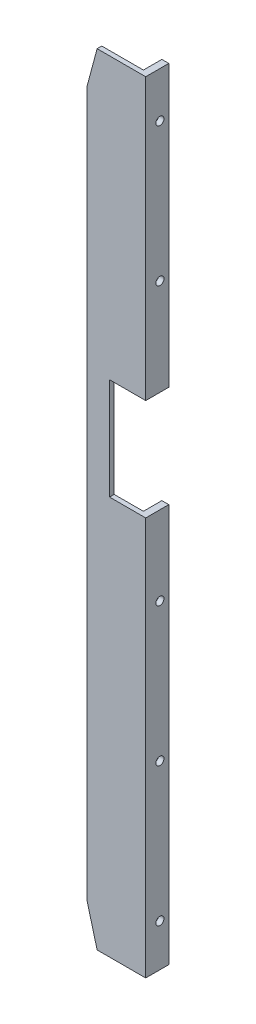
ISO-10303-21;
HEADER;
FILE_DESCRIPTION(('STEP AP214'),'2;1');
FILE_NAME('part.step','',(''),(''),'','','');
FILE_SCHEMA(('AUTOMOTIVE_DESIGN { 1 0 10303 214 1 1 1 1 }'));
ENDSEC;
DATA;
#1=APPLICATION_CONTEXT('core data for automotive mechanical design processes');
#2=APPLICATION_PROTOCOL_DEFINITION('international standard','automotive_design',2000,#1);
#3=PRODUCT_CONTEXT('',#1,'mechanical');
#4=PRODUCT('Part','Part','',(#3));
#5=PRODUCT_RELATED_PRODUCT_CATEGORY('part','',(#4));
#6=PRODUCT_DEFINITION_FORMATION('','',#4);
#7=PRODUCT_DEFINITION_CONTEXT('part definition',#1,'design');
#8=PRODUCT_DEFINITION('design','',#6,#7);
#9=PRODUCT_DEFINITION_SHAPE('','',#8);
#10=(LENGTH_UNIT() NAMED_UNIT(*) SI_UNIT(.MILLI.,.METRE.));
#11=(NAMED_UNIT(*) PLANE_ANGLE_UNIT() SI_UNIT($,.RADIAN.));
#12=(NAMED_UNIT(*) SI_UNIT($,.STERADIAN.) SOLID_ANGLE_UNIT());
#13=UNCERTAINTY_MEASURE_WITH_UNIT(LENGTH_MEASURE(1.E-05),#10,'distance_accuracy_value','');
#14=(GEOMETRIC_REPRESENTATION_CONTEXT(3) GLOBAL_UNCERTAINTY_ASSIGNED_CONTEXT((#13)) GLOBAL_UNIT_ASSIGNED_CONTEXT((#10,
#11,#12)) REPRESENTATION_CONTEXT('',''));
#15=CARTESIAN_POINT('',(0.,0.,0.));
#16=DIRECTION('',(0.,0.,1.));
#17=DIRECTION('',(1.,0.,0.));
#18=AXIS2_PLACEMENT_3D('',#15,#16,#17);
#19=CARTESIAN_POINT('',(198.029133429054,88.353396431631,-13.4124999999996));
#20=DIRECTION('',(0.999999999999998,0.,0.));
#21=DIRECTION('',(0.,0.,-0.999999999999998));
#22=AXIS2_PLACEMENT_3D('',#19,#20,#21);
#23=PLANE('',#22);
#24=CARTESIAN_POINT('',(198.029133429054,-527.011124934766,-7.640243296269));
#25=DIRECTION('',(0.999999999999998,0.,0.));
#26=DIRECTION('',(0.,0.,-0.999999999999998));
#27=AXIS2_PLACEMENT_3D('',#24,#25,#26);
#28=CIRCLE('',#27,2.19709999999995);
#29=CARTESIAN_POINT('',(198.029133429054,-527.011124934766,-9.83734329626895));
#30=VERTEX_POINT('',#29);
#31=EDGE_CURVE('E54',#30,#30,#28,.T.);
#32=ORIENTED_EDGE('',*,*,#31,.T.);
#33=EDGE_LOOP('',(#32));
#34=FACE_BOUND('',#33,.T.);
#35=CARTESIAN_POINT('',(198.029133429054,-437.011124934766,-7.640243296269));
#36=DIRECTION('',(0.999999999999998,0.,0.));
#37=DIRECTION('',(0.,0.,-0.999999999999998));
#38=AXIS2_PLACEMENT_3D('',#35,#36,#37);
#39=CIRCLE('',#38,2.19710000000001);
#40=CARTESIAN_POINT('',(198.029133429054,-437.011124934766,-9.837343296269));
#41=VERTEX_POINT('',#40);
#42=EDGE_CURVE('E291',#41,#41,#39,.T.);
#43=ORIENTED_EDGE('',*,*,#42,.T.);
#44=EDGE_LOOP('',(#43));
#45=FACE_BOUND('',#44,.T.);
#46=CARTESIAN_POINT('',(198.029133429054,-347.011124934766,-7.640243296269));
#47=DIRECTION('',(0.999999999999998,0.,0.));
#48=DIRECTION('',(0.,0.,-0.999999999999998));
#49=AXIS2_PLACEMENT_3D('',#46,#47,#48);
#50=CIRCLE('',#49,2.19710000000001);
#51=CARTESIAN_POINT('',(198.029133429054,-347.011124934766,-9.837343296269));
#52=VERTEX_POINT('',#51);
#53=EDGE_CURVE('E283',#52,#52,#50,.T.);
#54=ORIENTED_EDGE('',*,*,#53,.T.);
#55=EDGE_LOOP('',(#54));
#56=FACE_BOUND('',#55,.T.);
#57=DIRECTION('',(0.,-1.,0.));
#58=VECTOR('',#57,1.);
#59=CARTESIAN_POINT('',(198.029133429054,88.353396431631,-1.41250000000001));
#60=LINE('',#59,#58);
#61=CARTESIAN_POINT('',(198.029133429054,-295.700000000001,-1.41249999999979));
#62=VERTEX_POINT('',#61);
#63=CARTESIAN_POINT('',(198.029133429054,-554.500000000002,-1.41249999999979));
#64=VERTEX_POINT('',#63);
#65=EDGE_CURVE('E246',#62,#64,#60,.T.);
#66=ORIENTED_EDGE('',*,*,#65,.F.);
#67=DIRECTION('',(0.,0.,-0.999999999999998));
#68=VECTOR('',#67,1.);
#69=CARTESIAN_POINT('',(198.029133429054,-295.700000000001,-13.4124999999996));
#70=LINE('',#69,#68);
#71=CARTESIAN_POINT('',(198.029133429054,-295.700000000001,-13.4124999999996));
#72=VERTEX_POINT('',#71);
#73=EDGE_CURVE('E182',#62,#72,#70,.T.);
#74=ORIENTED_EDGE('',*,*,#73,.T.);
#75=DIRECTION('',(0.,-1.,0.));
#76=VECTOR('',#75,1.);
#77=CARTESIAN_POINT('',(198.029133429054,88.353396431631,-13.4124999999996));
#78=LINE('',#77,#76);
#79=CARTESIAN_POINT('',(198.029133429054,-554.500000000002,-13.4125));
#80=VERTEX_POINT('',#79);
#81=EDGE_CURVE('E248',#72,#80,#78,.T.);
#82=ORIENTED_EDGE('',*,*,#81,.T.);
#83=DIRECTION('',(0.,0.,-0.999999999999998));
#84=VECTOR('',#83,1.);
#85=CARTESIAN_POINT('',(198.029133429054,-554.500000000002,-13.4125));
#86=LINE('',#85,#84);
#87=EDGE_CURVE('E208',#64,#80,#86,.T.);
#88=ORIENTED_EDGE('',*,*,#87,.F.);
#89=EDGE_LOOP('',(#66,#74,#82,#88));
#90=FACE_BOUND('',#89,.T.);
#91=ADVANCED_FACE('F50',(#34,#45,#56,#90),#23,.F.);
#92=CARTESIAN_POINT('',(198.029133429054,88.353396431631,-13.4124999999996));
#93=DIRECTION('',(0.,0.,0.999999999999998));
#94=DIRECTION('',(0.999999999999998,0.,0.));
#95=AXIS2_PLACEMENT_3D('',#92,#93,#94);
#96=PLANE('',#95);
#97=ORIENTED_EDGE('',*,*,#81,.F.);
#98=DIRECTION('',(0.999999999999998,0.,0.));
#99=VECTOR('',#98,1.);
#100=CARTESIAN_POINT('',(198.029133429054,-295.700000000001,-13.4124999999996));
#101=LINE('',#100,#99);
#102=CARTESIAN_POINT('',(202.529133429054,-295.700000000001,-13.4124999999996));
#103=VERTEX_POINT('',#102);
#104=EDGE_CURVE('E175',#72,#103,#101,.T.);
#105=ORIENTED_EDGE('',*,*,#104,.T.);
#106=DIRECTION('',(0.,-1.,0.));
#107=VECTOR('',#106,1.);
#108=CARTESIAN_POINT('',(202.529133429054,88.3533964316319,-13.4124999999996));
#109=LINE('',#108,#107);
#110=CARTESIAN_POINT('',(202.529133429054,-554.500000000003,-13.4125));
#111=VERTEX_POINT('',#110);
#112=EDGE_CURVE('E252',#103,#111,#109,.T.);
#113=ORIENTED_EDGE('',*,*,#112,.T.);
#114=DIRECTION('',(0.999999999999998,0.,0.));
#115=VECTOR('',#114,1.);
#116=CARTESIAN_POINT('',(198.029133429054,-554.500000000002,-13.4125));
#117=LINE('',#116,#115);
#118=EDGE_CURVE('E220',#80,#111,#117,.T.);
#119=ORIENTED_EDGE('',*,*,#118,.F.);
#120=EDGE_LOOP('',(#97,#105,#113,#119));
#121=FACE_BOUND('',#120,.T.);
#122=ADVANCED_FACE('F353',(#121),#96,.F.);
#123=CARTESIAN_POINT('',(202.529133429054,88.3533964316319,-13.4124999999996));
#124=DIRECTION('',(-0.999999999999998,0.,0.));
#125=DIRECTION('',(0.,0.,0.999999999999998));
#126=AXIS2_PLACEMENT_3D('',#123,#124,#125);
#127=PLANE('',#126);
#128=CARTESIAN_POINT('',(202.529133429054,-527.011124934767,-7.640243296269));
#129=DIRECTION('',(-0.999999999999998,0.,0.));
#130=DIRECTION('',(0.,0.,0.999999999999998));
#131=AXIS2_PLACEMENT_3D('',#128,#129,#130);
#132=CIRCLE('',#131,2.63778999999997);
#133=CARTESIAN_POINT('',(202.529133429054,-527.011124934767,-5.00245329626903));
#134=VERTEX_POINT('',#133);
#135=EDGE_CURVE('E295',#134,#134,#132,.T.);
#136=ORIENTED_EDGE('',*,*,#135,.T.);
#137=EDGE_LOOP('',(#136));
#138=FACE_BOUND('',#137,.T.);
#139=CARTESIAN_POINT('',(202.529133429054,-437.011124934766,-7.640243296269));
#140=DIRECTION('',(-0.999999999999998,0.,0.));
#141=DIRECTION('',(0.,0.,0.999999999999998));
#142=AXIS2_PLACEMENT_3D('',#139,#140,#141);
#143=CIRCLE('',#142,2.63778999999997);
#144=CARTESIAN_POINT('',(202.529133429054,-437.011124934766,-5.00245329626903));
#145=VERTEX_POINT('',#144);
#146=EDGE_CURVE('E288',#145,#145,#143,.T.);
#147=ORIENTED_EDGE('',*,*,#146,.T.);
#148=EDGE_LOOP('',(#147));
#149=FACE_BOUND('',#148,.T.);
#150=CARTESIAN_POINT('',(202.529133429054,-347.011124934766,-7.640243296269));
#151=DIRECTION('',(-0.999999999999998,0.,0.));
#152=DIRECTION('',(0.,0.,0.999999999999998));
#153=AXIS2_PLACEMENT_3D('',#150,#151,#152);
#154=CIRCLE('',#153,2.63778999999997);
#155=CARTESIAN_POINT('',(202.529133429054,-347.011124934766,-5.00245329626903));
#156=VERTEX_POINT('',#155);
#157=EDGE_CURVE('E280',#156,#156,#154,.T.);
#158=ORIENTED_EDGE('',*,*,#157,.T.);
#159=EDGE_LOOP('',(#158));
#160=FACE_BOUND('',#159,.T.);
#161=ORIENTED_EDGE('',*,*,#112,.F.);
#162=DIRECTION('',(0.,0.,0.999999999999998));
#163=VECTOR('',#162,1.);
#164=CARTESIAN_POINT('',(202.529133429054,-295.700000000001,-13.4124999999996));
#165=LINE('',#164,#163);
#166=CARTESIAN_POINT('',(202.529133429054,-295.700000000001,1.58750000000021));
#167=VERTEX_POINT('',#166);
#168=EDGE_CURVE('E59',#103,#167,#165,.T.);
#169=ORIENTED_EDGE('',*,*,#168,.T.);
#170=DIRECTION('',(0.,-1.,0.));
#171=VECTOR('',#170,1.);
#172=CARTESIAN_POINT('',(202.529133429054,88.3533964316319,1.58749999999999));
#173=LINE('',#172,#171);
#174=CARTESIAN_POINT('',(202.529133429054,-554.500000000003,1.58750000000002));
#175=VERTEX_POINT('',#174);
#176=EDGE_CURVE('E223',#167,#175,#173,.T.);
#177=ORIENTED_EDGE('',*,*,#176,.T.);
#178=DIRECTION('',(0.,0.,0.999999999999998));
#179=VECTOR('',#178,1.);
#180=CARTESIAN_POINT('',(202.529133429054,-554.500000000003,-13.4125));
#181=LINE('',#180,#179);
#182=EDGE_CURVE('E217',#111,#175,#181,.T.);
#183=ORIENTED_EDGE('',*,*,#182,.F.);
#184=EDGE_LOOP('',(#161,#169,#177,#183));
#185=FACE_BOUND('',#184,.T.);
#186=ADVANCED_FACE('F356',(#138,#149,#160,#185),#127,.F.);
#187=CARTESIAN_POINT('',(164.529133429054,88.353396431631,1.58749999999977));
#188=DIRECTION('',(0.,0.,-0.999999999999998));
#189=DIRECTION('',(-0.999999999999998,0.,0.));
#190=AXIS2_PLACEMENT_3D('',#187,#188,#189);
#191=PLANE('',#190);
#192=ORIENTED_EDGE('',*,*,#176,.F.);
#193=DIRECTION('',(-0.999999999999998,0.,0.));
#194=VECTOR('',#193,1.);
#195=CARTESIAN_POINT('',(164.529133429054,-295.700000000001,1.58749999999999));
#196=LINE('',#195,#194);
#197=CARTESIAN_POINT('',(179.029133429054,-295.700000000001,1.58750000000021));
#198=VERTEX_POINT('',#197);
#199=EDGE_CURVE('E187',#167,#198,#196,.T.);
#200=ORIENTED_EDGE('',*,*,#199,.T.);
#201=DIRECTION('',(0.,1.,0.));
#202=VECTOR('',#201,1.);
#203=CARTESIAN_POINT('',(179.029133429054,88.353396431631,1.58749999999999));
#204=LINE('',#203,#202);
#205=CARTESIAN_POINT('',(179.029133429054,-229.700000000001,1.58749999999999));
#206=VERTEX_POINT('',#205);
#207=EDGE_CURVE('E190',#198,#206,#204,.T.);
#208=ORIENTED_EDGE('',*,*,#207,.T.);
#209=DIRECTION('',(0.999999999999998,0.,0.));
#210=VECTOR('',#209,1.);
#211=CARTESIAN_POINT('',(164.529133429054,-229.700000000002,1.58749999999977));
#212=LINE('',#211,#210);
#213=CARTESIAN_POINT('',(202.529133429054,-229.700000000001,1.58749999999999));
#214=VERTEX_POINT('',#213);
#215=EDGE_CURVE('E166',#206,#214,#212,.T.);
#216=ORIENTED_EDGE('',*,*,#215,.T.);
#217=CARTESIAN_POINT('',(202.529133429054,-47.5,1.58749999999999));
#218=VERTEX_POINT('',#217);
#219=EDGE_CURVE('E237',#218,#214,#173,.T.);
#220=ORIENTED_EDGE('',*,*,#219,.F.);
#221=DIRECTION('',(-0.999999999999998,0.,0.));
#222=VECTOR('',#221,1.);
#223=CARTESIAN_POINT('',(164.529133429054,-47.5,1.58749999999977));
#224=LINE('',#223,#222);
#225=CARTESIAN_POINT('',(170.97390714843,-47.5,1.58749999999999));
#226=VERTEX_POINT('',#225);
#227=EDGE_CURVE('E227',#218,#226,#224,.T.);
#228=ORIENTED_EDGE('',*,*,#227,.T.);
#229=DIRECTION('',(-0.258819045102521,-0.965925826289072,0.));
#230=VECTOR('',#229,1.);
#231=CARTESIAN_POINT('',(204.505538277961,77.6417510360676,1.58749999999999));
#232=LINE('',#231,#230);
#233=CARTESIAN_POINT('',(164.529133429054,-71.5522229639971,1.58749999999977));
#234=VERTEX_POINT('',#233);
#235=EDGE_CURVE('E205',#226,#234,#232,.T.);
#236=ORIENTED_EDGE('',*,*,#235,.T.);
#237=DIRECTION('',(0.,-1.,0.));
#238=VECTOR('',#237,1.);
#239=CARTESIAN_POINT('',(164.529133429054,88.353396431631,1.58749999999977));
#240=LINE('',#239,#238);
#241=CARTESIAN_POINT('',(164.529133429054,-530.447777036005,1.58749999999999));
#242=VERTEX_POINT('',#241);
#243=EDGE_CURVE('E240',#234,#242,#240,.T.);
#244=ORIENTED_EDGE('',*,*,#243,.T.);
#245=DIRECTION('',(0.258819045102521,-0.965925826289072,0.));
#246=VECTOR('',#245,1.);
#247=CARTESIAN_POINT('',(9.82884006214532,46.9015777551098,1.5874999999998));
#248=LINE('',#247,#246);
#249=CARTESIAN_POINT('',(170.97390714843,-554.500000000002,1.58750000000024));
#250=VERTEX_POINT('',#249);
#251=EDGE_CURVE('E196',#242,#250,#248,.T.);
#252=ORIENTED_EDGE('',*,*,#251,.T.);
#253=DIRECTION('',(-0.999999999999998,0.,0.));
#254=VECTOR('',#253,1.);
#255=CARTESIAN_POINT('',(164.529133429054,-554.500000000002,1.58749999999999));
#256=LINE('',#255,#254);
#257=EDGE_CURVE('E214',#175,#250,#256,.T.);
#258=ORIENTED_EDGE('',*,*,#257,.F.);
#259=EDGE_LOOP('',(#192,#200,#208,#216,#220,#228,#236,#244,#252,#258));
#260=FACE_BOUND('',#259,.T.);
#261=ADVANCED_FACE('F340',(#260),#191,.F.);
#262=CARTESIAN_POINT('',(164.529133429054,88.353396431631,-1.41250000000021));
#263=DIRECTION('',(0.999999999999998,0.,0.));
#264=DIRECTION('',(0.,0.,-0.999999999999998));
#265=AXIS2_PLACEMENT_3D('',#262,#263,#264);
#266=PLANE('',#265);
#267=DIRECTION('',(0.,-1.,0.));
#268=VECTOR('',#267,1.);
#269=CARTESIAN_POINT('',(164.529133429054,88.353396431631,-1.41250000000021));
#270=LINE('',#269,#268);
#271=CARTESIAN_POINT('',(164.529133429054,-71.5522229639972,-1.41250000000021));
#272=VERTEX_POINT('',#271);
#273=CARTESIAN_POINT('',(164.529133429054,-530.447777036005,-1.41249999999998));
#274=VERTEX_POINT('',#273);
#275=EDGE_CURVE('E243',#272,#274,#270,.T.);
#276=ORIENTED_EDGE('',*,*,#275,.T.);
#277=DIRECTION('',(0.,0.,0.999999999999998));
#278=VECTOR('',#277,1.);
#279=CARTESIAN_POINT('',(164.529133429054,-530.447777036005,-1.41249999999998));
#280=LINE('',#279,#278);
#281=EDGE_CURVE('E193',#274,#242,#280,.T.);
#282=ORIENTED_EDGE('',*,*,#281,.T.);
#283=ORIENTED_EDGE('',*,*,#243,.F.);
#284=DIRECTION('',(0.,0.,-0.999999999999998));
#285=VECTOR('',#284,1.);
#286=CARTESIAN_POINT('',(164.529133429054,-71.5522229639971,-1.41250000000021));
#287=LINE('',#286,#285);
#288=EDGE_CURVE('E202',#234,#272,#287,.T.);
#289=ORIENTED_EDGE('',*,*,#288,.T.);
#290=EDGE_LOOP('',(#276,#282,#283,#289));
#291=FACE_BOUND('',#290,.T.);
#292=ADVANCED_FACE('F361',(#291),#266,.F.);
#293=CARTESIAN_POINT('',(198.029133429054,88.353396431631,-1.41250000000001));
#294=DIRECTION('',(0.,0.,0.999999999999998));
#295=DIRECTION('',(0.999999999999998,0.,0.));
#296=AXIS2_PLACEMENT_3D('',#293,#294,#295);
#297=PLANE('',#296);
#298=DIRECTION('',(0.,-1.,0.));
#299=VECTOR('',#298,1.);
#300=CARTESIAN_POINT('',(179.029133429054,88.353396431631,-1.41250000000001));
#301=LINE('',#300,#299);
#302=CARTESIAN_POINT('',(179.029133429054,-229.700000000001,-1.41250000000001));
#303=VERTEX_POINT('',#302);
#304=CARTESIAN_POINT('',(179.029133429054,-295.700000000001,-1.41249999999976));
#305=VERTEX_POINT('',#304);
#306=EDGE_CURVE('E13',#303,#305,#301,.T.);
#307=ORIENTED_EDGE('',*,*,#306,.T.);
#308=DIRECTION('',(0.999999999999998,0.,0.));
#309=VECTOR('',#308,1.);
#310=CARTESIAN_POINT('',(198.029133429054,-295.700000000001,-1.41249999999979));
#311=LINE('',#310,#309);
#312=EDGE_CURVE('E185',#305,#62,#311,.T.);
#313=ORIENTED_EDGE('',*,*,#312,.T.);
#314=ORIENTED_EDGE('',*,*,#65,.T.);
#315=DIRECTION('',(0.999999999999998,0.,0.));
#316=VECTOR('',#315,1.);
#317=CARTESIAN_POINT('',(198.029133429054,-554.500000000002,-1.41249999999979));
#318=LINE('',#317,#316);
#319=CARTESIAN_POINT('',(170.97390714843,-554.500000000002,-1.41249999999979));
#320=VERTEX_POINT('',#319);
#321=EDGE_CURVE('E211',#320,#64,#318,.T.);
#322=ORIENTED_EDGE('',*,*,#321,.F.);
#323=DIRECTION('',(-0.258819045102521,0.965925826289072,0.));
#324=VECTOR('',#323,1.);
#325=CARTESIAN_POINT('',(12.072914548756,38.5265777551098,-1.41250000000018));
#326=LINE('',#325,#324);
#327=EDGE_CURVE('E75',#320,#274,#326,.T.);
#328=ORIENTED_EDGE('',*,*,#327,.T.);
#329=ORIENTED_EDGE('',*,*,#275,.F.);
#330=DIRECTION('',(0.258819045102521,0.965925826289072,0.));
#331=VECTOR('',#330,1.);
#332=CARTESIAN_POINT('',(206.749612764572,86.0167510360676,-1.41250000000001));
#333=LINE('',#332,#331);
#334=CARTESIAN_POINT('',(170.97390714843,-47.5,-1.41249999999998));
#335=VERTEX_POINT('',#334);
#336=EDGE_CURVE('E199',#272,#335,#333,.T.);
#337=ORIENTED_EDGE('',*,*,#336,.T.);
#338=DIRECTION('',(0.999999999999998,0.,0.));
#339=VECTOR('',#338,1.);
#340=CARTESIAN_POINT('',(198.029133429054,-47.5000000000009,-1.41250000000001));
#341=LINE('',#340,#339);
#342=CARTESIAN_POINT('',(198.029133429054,-47.5000000000009,-1.41250000000001));
#343=VERTEX_POINT('',#342);
#344=EDGE_CURVE('E224',#335,#343,#341,.T.);
#345=ORIENTED_EDGE('',*,*,#344,.T.);
#346=CARTESIAN_POINT('',(198.029133429054,-229.700000000001,-1.41250000000001));
#347=VERTEX_POINT('',#346);
#348=EDGE_CURVE('E172',#343,#347,#60,.T.);
#349=ORIENTED_EDGE('',*,*,#348,.T.);
#350=DIRECTION('',(-0.999999999999998,0.,0.));
#351=VECTOR('',#350,1.);
#352=CARTESIAN_POINT('',(198.029133429054,-229.700000000001,-1.41250000000001));
#353=LINE('',#352,#351);
#354=EDGE_CURVE('E163',#347,#303,#353,.T.);
#355=ORIENTED_EDGE('',*,*,#354,.T.);
#356=EDGE_LOOP('',(#307,#313,#314,#322,#328,#329,#337,#345,#349,#355));
#357=FACE_BOUND('',#356,.T.);
#358=ADVANCED_FACE('F170',(#357),#297,.F.);
#359=CARTESIAN_POINT('',(198.029133429054,-167.011124934765,-7.640243296269));
#360=DIRECTION('',(0.999999999999998,0.,0.));
#361=DIRECTION('',(0.,0.,-0.999999999999998));
#362=AXIS2_PLACEMENT_3D('',#359,#360,#361);
#363=CIRCLE('',#362,2.19709999999999);
#364=CARTESIAN_POINT('',(198.029133429054,-167.011124934765,-9.83734329626899));
#365=VERTEX_POINT('',#364);
#366=EDGE_CURVE('E275',#365,#365,#363,.T.);
#367=ORIENTED_EDGE('',*,*,#366,.T.);
#368=EDGE_LOOP('',(#367));
#369=FACE_BOUND('',#368,.T.);
#370=CARTESIAN_POINT('',(198.029133429054,-77.011124934765,-7.640243296269));
#371=DIRECTION('',(0.999999999999998,0.,0.));
#372=DIRECTION('',(0.,0.,-0.999999999999998));
#373=AXIS2_PLACEMENT_3D('',#370,#371,#372);
#374=CIRCLE('',#373,2.19709999999999);
#375=CARTESIAN_POINT('',(198.029133429054,-77.011124934765,-9.83734329626899));
#376=VERTEX_POINT('',#375);
#377=EDGE_CURVE('E167',#376,#376,#374,.T.);
#378=ORIENTED_EDGE('',*,*,#377,.T.);
#379=EDGE_LOOP('',(#378));
#380=FACE_BOUND('',#379,.T.);
#381=CARTESIAN_POINT('',(198.029133429054,-47.5000000000009,-13.4125));
#382=VERTEX_POINT('',#381);
#383=CARTESIAN_POINT('',(198.029133429054,-229.700000000001,-13.4125));
#384=VERTEX_POINT('',#383);
#385=EDGE_CURVE('E249',#382,#384,#78,.T.);
#386=ORIENTED_EDGE('',*,*,#385,.T.);
#387=DIRECTION('',(0.,0.,0.999999999999998));
#388=VECTOR('',#387,1.);
#389=CARTESIAN_POINT('',(198.029133429054,-229.700000000001,-13.4125));
#390=LINE('',#389,#388);
#391=EDGE_CURVE('E173',#384,#347,#390,.T.);
#392=ORIENTED_EDGE('',*,*,#391,.T.);
#393=ORIENTED_EDGE('',*,*,#348,.F.);
#394=DIRECTION('',(0.,0.,-0.999999999999998));
#395=VECTOR('',#394,1.);
#396=CARTESIAN_POINT('',(198.029133429054,-47.5000000000009,-13.4125));
#397=LINE('',#396,#395);
#398=EDGE_CURVE('E226',#343,#382,#397,.T.);
#399=ORIENTED_EDGE('',*,*,#398,.T.);
#400=EDGE_LOOP('',(#386,#392,#393,#399));
#401=FACE_BOUND('',#400,.T.);
#402=ADVANCED_FACE('F331',(#369,#380,#401),#23,.F.);
#403=CARTESIAN_POINT('',(202.529133429054,-47.5,-13.4125));
#404=VERTEX_POINT('',#403);
#405=CARTESIAN_POINT('',(202.529133429054,-229.700000000001,-13.4125));
#406=VERTEX_POINT('',#405);
#407=EDGE_CURVE('E253',#404,#406,#109,.T.);
#408=ORIENTED_EDGE('',*,*,#407,.T.);
#409=DIRECTION('',(-0.999999999999998,0.,0.));
#410=VECTOR('',#409,1.);
#411=CARTESIAN_POINT('',(198.029133429054,-229.700000000001,-13.4125));
#412=LINE('',#411,#410);
#413=EDGE_CURVE('E67',#406,#384,#412,.T.);
#414=ORIENTED_EDGE('',*,*,#413,.T.);
#415=ORIENTED_EDGE('',*,*,#385,.F.);
#416=DIRECTION('',(0.999999999999998,0.,0.));
#417=VECTOR('',#416,1.);
#418=CARTESIAN_POINT('',(198.029133429054,-47.5000000000009,-13.4125));
#419=LINE('',#418,#417);
#420=EDGE_CURVE('E230',#382,#404,#419,.T.);
#421=ORIENTED_EDGE('',*,*,#420,.T.);
#422=EDGE_LOOP('',(#408,#414,#415,#421));
#423=FACE_BOUND('',#422,.T.);
#424=ADVANCED_FACE('F328',(#423),#96,.F.);
#425=CARTESIAN_POINT('',(202.529133429054,-167.011124934765,-7.640243296269));
#426=DIRECTION('',(-0.999999999999998,0.,0.));
#427=DIRECTION('',(0.,0.,0.999999999999998));
#428=AXIS2_PLACEMENT_3D('',#425,#426,#427);
#429=CIRCLE('',#428,2.63779);
#430=CARTESIAN_POINT('',(202.529133429054,-167.011124934765,-5.002453296269));
#431=VERTEX_POINT('',#430);
#432=EDGE_CURVE('E272',#431,#431,#429,.T.);
#433=ORIENTED_EDGE('',*,*,#432,.T.);
#434=EDGE_LOOP('',(#433));
#435=FACE_BOUND('',#434,.T.);
#436=CARTESIAN_POINT('',(202.529133429054,-77.0111249347641,-7.640243296269));
#437=DIRECTION('',(-0.999999999999998,0.,0.));
#438=DIRECTION('',(0.,0.,0.999999999999998));
#439=AXIS2_PLACEMENT_3D('',#436,#437,#438);
#440=CIRCLE('',#439,2.63779);
#441=CARTESIAN_POINT('',(202.529133429054,-77.0111249347641,-5.002453296269));
#442=VERTEX_POINT('',#441);
#443=EDGE_CURVE('E266',#442,#442,#440,.T.);
#444=ORIENTED_EDGE('',*,*,#443,.T.);
#445=EDGE_LOOP('',(#444));
#446=FACE_BOUND('',#445,.T.);
#447=ORIENTED_EDGE('',*,*,#219,.T.);
#448=DIRECTION('',(0.,0.,-0.999999999999998));
#449=VECTOR('',#448,1.);
#450=CARTESIAN_POINT('',(202.529133429054,-229.700000000001,-13.4125));
#451=LINE('',#450,#449);
#452=EDGE_CURVE('E262',#214,#406,#451,.T.);
#453=ORIENTED_EDGE('',*,*,#452,.T.);
#454=ORIENTED_EDGE('',*,*,#407,.F.);
#455=DIRECTION('',(0.,0.,0.999999999999998));
#456=VECTOR('',#455,1.);
#457=CARTESIAN_POINT('',(202.529133429054,-47.5,-13.4125));
#458=LINE('',#457,#456);
#459=EDGE_CURVE('E233',#404,#218,#458,.T.);
#460=ORIENTED_EDGE('',*,*,#459,.T.);
#461=EDGE_LOOP('',(#447,#453,#454,#460));
#462=FACE_BOUND('',#461,.T.);
#463=ADVANCED_FACE('F52',(#435,#446,#462),#127,.F.);
#464=CARTESIAN_POINT('',(168.229133429054,-47.5,50.8));
#465=DIRECTION('',(0.,-1.,0.));
#466=DIRECTION('',(0.,0.,-0.999999999999998));
#467=AXIS2_PLACEMENT_3D('',#464,#465,#466);
#468=PLANE('',#467);
#469=ORIENTED_EDGE('',*,*,#344,.F.);
#470=DIRECTION('',(0.,0.,0.999999999999998));
#471=VECTOR('',#470,1.);
#472=CARTESIAN_POINT('',(170.97390714843,-47.5,50.8));
#473=LINE('',#472,#471);
#474=EDGE_CURVE('E236',#335,#226,#473,.T.);
#475=ORIENTED_EDGE('',*,*,#474,.T.);
#476=ORIENTED_EDGE('',*,*,#227,.F.);
#477=ORIENTED_EDGE('',*,*,#459,.F.);
#478=ORIENTED_EDGE('',*,*,#420,.F.);
#479=ORIENTED_EDGE('',*,*,#398,.F.);
#480=EDGE_LOOP('',(#469,#475,#476,#477,#478,#479));
#481=FACE_BOUND('',#480,.T.);
#482=ADVANCED_FACE('F335',(#481),#468,.F.);
#483=CARTESIAN_POINT('',(168.229133429054,-554.500000000002,50.8));
#484=DIRECTION('',(0.,1.,0.));
#485=DIRECTION('',(0.,0.,0.999999999999998));
#486=AXIS2_PLACEMENT_3D('',#483,#484,#485);
#487=PLANE('',#486);
#488=ORIENTED_EDGE('',*,*,#257,.T.);
#489=DIRECTION('',(0.,0.,-0.999999999999998));
#490=VECTOR('',#489,1.);
#491=CARTESIAN_POINT('',(170.97390714843,-554.500000000002,50.8));
#492=LINE('',#491,#490);
#493=EDGE_CURVE('E260',#250,#320,#492,.T.);
#494=ORIENTED_EDGE('',*,*,#493,.T.);
#495=ORIENTED_EDGE('',*,*,#321,.T.);
#496=ORIENTED_EDGE('',*,*,#87,.T.);
#497=ORIENTED_EDGE('',*,*,#118,.T.);
#498=ORIENTED_EDGE('',*,*,#182,.T.);
#499=EDGE_LOOP('',(#488,#494,#495,#496,#497,#498));
#500=FACE_BOUND('',#499,.T.);
#501=ADVANCED_FACE('F350',(#500),#487,.F.);
#502=CARTESIAN_POINT('',(170.97390714843,-47.5000000000009,-74.9999999999996));
#503=DIRECTION('',(0.965925826289066,-0.258819045102522,0.));
#504=DIRECTION('',(0.258819045102521,0.965925826289072,0.));
#505=AXIS2_PLACEMENT_3D('',#502,#503,#504);
#506=PLANE('',#505);
#507=ORIENTED_EDGE('',*,*,#474,.F.);
#508=ORIENTED_EDGE('',*,*,#336,.F.);
#509=ORIENTED_EDGE('',*,*,#288,.F.);
#510=ORIENTED_EDGE('',*,*,#235,.F.);
#511=EDGE_LOOP('',(#507,#508,#509,#510));
#512=FACE_BOUND('',#511,.T.);
#513=ADVANCED_FACE('F364',(#512),#506,.F.);
#514=CARTESIAN_POINT('',(170.97390714843,-554.500000000002,-74.9999999999996));
#515=DIRECTION('',(0.965925826289066,0.258819045102522,0.));
#516=DIRECTION('',(-0.258819045102521,0.965925826289072,0.));
#517=AXIS2_PLACEMENT_3D('',#514,#515,#516);
#518=PLANE('',#517);
#519=ORIENTED_EDGE('',*,*,#281,.F.);
#520=ORIENTED_EDGE('',*,*,#327,.F.);
#521=ORIENTED_EDGE('',*,*,#493,.F.);
#522=ORIENTED_EDGE('',*,*,#251,.F.);
#523=EDGE_LOOP('',(#519,#520,#521,#522));
#524=FACE_BOUND('',#523,.T.);
#525=ADVANCED_FACE('F359',(#524),#518,.F.);
#526=CARTESIAN_POINT('',(179.029133429054,-229.700000000001,-45.9999999999995));
#527=DIRECTION('',(-0.999999999999998,0.,0.));
#528=DIRECTION('',(0.,0.,0.999999999999998));
#529=AXIS2_PLACEMENT_3D('',#526,#527,#528);
#530=PLANE('',#529);
#531=DIRECTION('',(0.,0.,0.999999999999998));
#532=VECTOR('',#531,1.);
#533=CARTESIAN_POINT('',(179.029133429054,-295.700000000001,-45.9999999999995));
#534=LINE('',#533,#532);
#535=EDGE_CURVE('E158',#305,#198,#534,.T.);
#536=ORIENTED_EDGE('',*,*,#535,.F.);
#537=ORIENTED_EDGE('',*,*,#306,.F.);
#538=DIRECTION('',(0.,0.,0.999999999999998));
#539=VECTOR('',#538,1.);
#540=CARTESIAN_POINT('',(179.029133429054,-229.700000000001,-45.9999999999995));
#541=LINE('',#540,#539);
#542=EDGE_CURVE('E155',#303,#206,#541,.T.);
#543=ORIENTED_EDGE('',*,*,#542,.T.);
#544=ORIENTED_EDGE('',*,*,#207,.F.);
#545=EDGE_LOOP('',(#536,#537,#543,#544));
#546=FACE_BOUND('',#545,.T.);
#547=ADVANCED_FACE('F154',(#546),#530,.F.);
#548=CARTESIAN_POINT('',(209.029133429054,-295.700000000001,-45.9999999999995));
#549=DIRECTION('',(0.,-1.,0.));
#550=DIRECTION('',(0.,0.,-0.999999999999998));
#551=AXIS2_PLACEMENT_3D('',#548,#549,#550);
#552=PLANE('',#551);
#553=ORIENTED_EDGE('',*,*,#168,.F.);
#554=ORIENTED_EDGE('',*,*,#104,.F.);
#555=ORIENTED_EDGE('',*,*,#73,.F.);
#556=ORIENTED_EDGE('',*,*,#312,.F.);
#557=ORIENTED_EDGE('',*,*,#535,.T.);
#558=ORIENTED_EDGE('',*,*,#199,.F.);
#559=EDGE_LOOP('',(#553,#554,#555,#556,#557,#558));
#560=FACE_BOUND('',#559,.T.);
#561=ADVANCED_FACE('F342',(#560),#552,.F.);
#562=CARTESIAN_POINT('',(209.029133429054,-229.700000000001,-46.));
#563=DIRECTION('',(0.,1.,0.));
#564=DIRECTION('',(0.,0.,0.999999999999998));
#565=AXIS2_PLACEMENT_3D('',#562,#563,#564);
#566=PLANE('',#565);
#567=ORIENTED_EDGE('',*,*,#542,.F.);
#568=ORIENTED_EDGE('',*,*,#354,.F.);
#569=ORIENTED_EDGE('',*,*,#391,.F.);
#570=ORIENTED_EDGE('',*,*,#413,.F.);
#571=ORIENTED_EDGE('',*,*,#452,.F.);
#572=ORIENTED_EDGE('',*,*,#215,.F.);
#573=EDGE_LOOP('',(#567,#568,#569,#570,#571,#572));
#574=FACE_BOUND('',#573,.T.);
#575=ADVANCED_FACE('F162',(#574),#566,.F.);
#576=CARTESIAN_POINT('',(204.029133429054,-77.0111249347641,-7.640243296269));
#577=DIRECTION('',(0.999999999999998,0.,0.));
#578=DIRECTION('',(0.,0.,-0.999999999999998));
#579=AXIS2_PLACEMENT_3D('',#576,#577,#578);
#580=CYLINDRICAL_SURFACE('',#579,2.19709999999999);
#581=CARTESIAN_POINT('',(199.029133429054,-77.011124934765,-7.640243296269));
#582=DIRECTION('',(0.999999999999998,0.,0.));
#583=DIRECTION('',(0.,0.,-0.999999999999998));
#584=AXIS2_PLACEMENT_3D('',#581,#582,#583);
#585=CIRCLE('',#584,2.19710000000001);
#586=CARTESIAN_POINT('',(199.029133429054,-77.011124934765,-9.837343296269));
#587=VERTEX_POINT('',#586);
#588=EDGE_CURVE('E269',#587,#587,#585,.T.);
#589=ORIENTED_EDGE('',*,*,#588,.T.);
#590=EDGE_LOOP('',(#589));
#591=FACE_BOUND('',#590,.T.);
#592=ORIENTED_EDGE('',*,*,#377,.F.);
#593=EDGE_LOOP('',(#592));
#594=FACE_BOUND('',#593,.T.);
#595=ADVANCED_FACE('F391',(#591,#594),#580,.F.);
#596=CARTESIAN_POINT('',(204.029133429054,-77.0111249347641,-7.640243296269));
#597=DIRECTION('',(0.999999999999998,0.,0.));
#598=DIRECTION('',(0.,0.,-0.999999999999998));
#599=AXIS2_PLACEMENT_3D('',#596,#597,#598);
#600=CYLINDRICAL_SURFACE('',#599,2.63779);
#601=CARTESIAN_POINT('',(199.029133429054,-77.011124934765,-7.640243296269));
#602=DIRECTION('',(0.999999999999998,0.,0.));
#603=DIRECTION('',(0.,0.,-0.999999999999998));
#604=AXIS2_PLACEMENT_3D('',#601,#602,#603);
#605=CIRCLE('',#604,2.63779);
#606=CARTESIAN_POINT('',(199.029133429054,-77.011124934765,-10.278033296269));
#607=VERTEX_POINT('',#606);
#608=EDGE_CURVE('E279',#607,#607,#605,.T.);
#609=ORIENTED_EDGE('',*,*,#608,.F.);
#610=EDGE_LOOP('',(#609));
#611=FACE_BOUND('',#610,.T.);
#612=ORIENTED_EDGE('',*,*,#443,.F.);
#613=EDGE_LOOP('',(#612));
#614=FACE_BOUND('',#613,.T.);
#615=ADVANCED_FACE('F393',(#611,#614),#600,.F.);
#616=CARTESIAN_POINT('',(199.029133429054,-74.814024934765,-7.640243296269));
#617=DIRECTION('',(-0.999999999999998,0.,0.));
#618=DIRECTION('',(0.,0.,0.999999999999998));
#619=AXIS2_PLACEMENT_3D('',#616,#617,#618);
#620=PLANE('',#619);
#621=ORIENTED_EDGE('',*,*,#588,.F.);
#622=EDGE_LOOP('',(#621));
#623=FACE_BOUND('',#622,.T.);
#624=ORIENTED_EDGE('',*,*,#608,.T.);
#625=EDGE_LOOP('',(#624));
#626=FACE_BOUND('',#625,.T.);
#627=ADVANCED_FACE('F400',(#623,#626),#620,.F.);
#628=CARTESIAN_POINT('',(204.029133429054,-167.011124934765,-7.640243296269));
#629=DIRECTION('',(0.999999999999998,0.,0.));
#630=DIRECTION('',(0.,0.,-0.999999999999998));
#631=AXIS2_PLACEMENT_3D('',#628,#629,#630);
#632=CYLINDRICAL_SURFACE('',#631,2.19709999999999);
#633=CARTESIAN_POINT('',(199.029133429054,-167.011124934765,-7.640243296269));
#634=DIRECTION('',(0.999999999999998,0.,0.));
#635=DIRECTION('',(0.,0.,-0.999999999999998));
#636=AXIS2_PLACEMENT_3D('',#633,#634,#635);
#637=CIRCLE('',#636,2.19710000000001);
#638=CARTESIAN_POINT('',(199.029133429054,-167.011124934765,-9.837343296269));
#639=VERTEX_POINT('',#638);
#640=EDGE_CURVE('E276',#639,#639,#637,.T.);
#641=ORIENTED_EDGE('',*,*,#640,.T.);
#642=EDGE_LOOP('',(#641));
#643=FACE_BOUND('',#642,.T.);
#644=ORIENTED_EDGE('',*,*,#366,.F.);
#645=EDGE_LOOP('',(#644));
#646=FACE_BOUND('',#645,.T.);
#647=ADVANCED_FACE('F440',(#643,#646),#632,.F.);
#648=CARTESIAN_POINT('',(204.029133429054,-167.011124934765,-7.640243296269));
#649=DIRECTION('',(0.999999999999998,0.,0.));
#650=DIRECTION('',(0.,0.,-0.999999999999998));
#651=AXIS2_PLACEMENT_3D('',#648,#649,#650);
#652=CYLINDRICAL_SURFACE('',#651,2.63779);
#653=CARTESIAN_POINT('',(199.029133429054,-167.011124934765,-7.640243296269));
#654=DIRECTION('',(0.999999999999998,0.,0.));
#655=DIRECTION('',(0.,0.,-0.999999999999998));
#656=AXIS2_PLACEMENT_3D('',#653,#654,#655);
#657=CIRCLE('',#656,2.63779);
#658=CARTESIAN_POINT('',(199.029133429054,-167.011124934765,-10.278033296269));
#659=VERTEX_POINT('',#658);
#660=EDGE_CURVE('E287',#659,#659,#657,.T.);
#661=ORIENTED_EDGE('',*,*,#660,.F.);
#662=EDGE_LOOP('',(#661));
#663=FACE_BOUND('',#662,.T.);
#664=ORIENTED_EDGE('',*,*,#432,.F.);
#665=EDGE_LOOP('',(#664));
#666=FACE_BOUND('',#665,.T.);
#667=ADVANCED_FACE('F450',(#663,#666),#652,.F.);
#668=CARTESIAN_POINT('',(199.029133429054,-164.814024934765,-7.640243296269));
#669=DIRECTION('',(-0.999999999999998,0.,0.));
#670=DIRECTION('',(0.,0.,0.999999999999998));
#671=AXIS2_PLACEMENT_3D('',#668,#669,#670);
#672=PLANE('',#671);
#673=ORIENTED_EDGE('',*,*,#640,.F.);
#674=EDGE_LOOP('',(#673));
#675=FACE_BOUND('',#674,.T.);
#676=ORIENTED_EDGE('',*,*,#660,.T.);
#677=EDGE_LOOP('',(#676));
#678=FACE_BOUND('',#677,.T.);
#679=ADVANCED_FACE('F461',(#675,#678),#672,.F.);
#680=CARTESIAN_POINT('',(204.029133429054,-347.011124934766,-7.640243296269));
#681=DIRECTION('',(0.999999999999998,0.,0.));
#682=DIRECTION('',(0.,0.,-0.999999999999998));
#683=AXIS2_PLACEMENT_3D('',#680,#681,#682);
#684=CYLINDRICAL_SURFACE('',#683,2.19710000000001);
#685=CARTESIAN_POINT('',(199.029133429054,-347.011124934766,-7.640243296269));
#686=DIRECTION('',(0.999999999999998,0.,0.));
#687=DIRECTION('',(0.,0.,-0.999999999999998));
#688=AXIS2_PLACEMENT_3D('',#685,#686,#687);
#689=CIRCLE('',#688,2.19710000000001);
#690=CARTESIAN_POINT('',(199.029133429054,-347.011124934766,-9.837343296269));
#691=VERTEX_POINT('',#690);
#692=EDGE_CURVE('E284',#691,#691,#689,.T.);
#693=ORIENTED_EDGE('',*,*,#692,.T.);
#694=EDGE_LOOP('',(#693));
#695=FACE_BOUND('',#694,.T.);
#696=ORIENTED_EDGE('',*,*,#53,.F.);
#697=EDGE_LOOP('',(#696));
#698=FACE_BOUND('',#697,.T.);
#699=ADVANCED_FACE('F473',(#695,#698),#684,.F.);
#700=CARTESIAN_POINT('',(204.029133429054,-347.011124934766,-7.640243296269));
#701=DIRECTION('',(0.999999999999998,0.,0.));
#702=DIRECTION('',(0.,0.,-0.999999999999998));
#703=AXIS2_PLACEMENT_3D('',#700,#701,#702);
#704=CYLINDRICAL_SURFACE('',#703,2.63778999999997);
#705=CARTESIAN_POINT('',(199.029133429054,-347.011124934766,-7.640243296269));
#706=DIRECTION('',(0.999999999999998,0.,0.));
#707=DIRECTION('',(0.,0.,-0.999999999999998));
#708=AXIS2_PLACEMENT_3D('',#705,#706,#707);
#709=CIRCLE('',#708,2.63778999999997);
#710=CARTESIAN_POINT('',(199.029133429054,-347.011124934766,-10.278033296269));
#711=VERTEX_POINT('',#710);
#712=EDGE_CURVE('E294',#711,#711,#709,.T.);
#713=ORIENTED_EDGE('',*,*,#712,.F.);
#714=EDGE_LOOP('',(#713));
#715=FACE_BOUND('',#714,.T.);
#716=ORIENTED_EDGE('',*,*,#157,.F.);
#717=EDGE_LOOP('',(#716));
#718=FACE_BOUND('',#717,.T.);
#719=ADVANCED_FACE('F485',(#715,#718),#704,.F.);
#720=CARTESIAN_POINT('',(199.029133429054,-344.814024934765,-7.640243296269));
#721=DIRECTION('',(-0.999999999999998,0.,0.));
#722=DIRECTION('',(0.,0.,0.999999999999998));
#723=AXIS2_PLACEMENT_3D('',#720,#721,#722);
#724=PLANE('',#723);
#725=ORIENTED_EDGE('',*,*,#692,.F.);
#726=EDGE_LOOP('',(#725));
#727=FACE_BOUND('',#726,.T.);
#728=ORIENTED_EDGE('',*,*,#712,.T.);
#729=EDGE_LOOP('',(#728));
#730=FACE_BOUND('',#729,.T.);
#731=ADVANCED_FACE('F496',(#727,#730),#724,.F.);
#732=CARTESIAN_POINT('',(204.029133429054,-437.011124934766,-7.640243296269));
#733=DIRECTION('',(0.999999999999998,0.,0.));
#734=DIRECTION('',(0.,0.,-0.999999999999998));
#735=AXIS2_PLACEMENT_3D('',#732,#733,#734);
#736=CYLINDRICAL_SURFACE('',#735,2.19710000000001);
#737=CARTESIAN_POINT('',(199.029133429054,-437.011124934766,-7.640243296269));
#738=DIRECTION('',(0.999999999999998,0.,0.));
#739=DIRECTION('',(0.,0.,-0.999999999999998));
#740=AXIS2_PLACEMENT_3D('',#737,#738,#739);
#741=CIRCLE('',#740,2.19710000000001);
#742=CARTESIAN_POINT('',(199.029133429054,-437.011124934766,-9.837343296269));
#743=VERTEX_POINT('',#742);
#744=EDGE_CURVE('E292',#743,#743,#741,.T.);
#745=ORIENTED_EDGE('',*,*,#744,.T.);
#746=EDGE_LOOP('',(#745));
#747=FACE_BOUND('',#746,.T.);
#748=ORIENTED_EDGE('',*,*,#42,.F.);
#749=EDGE_LOOP('',(#748));
#750=FACE_BOUND('',#749,.T.);
#751=ADVANCED_FACE('F506',(#747,#750),#736,.F.);
#752=CARTESIAN_POINT('',(204.029133429054,-437.011124934766,-7.640243296269));
#753=DIRECTION('',(0.999999999999998,0.,0.));
#754=DIRECTION('',(0.,0.,-0.999999999999998));
#755=AXIS2_PLACEMENT_3D('',#752,#753,#754);
#756=CYLINDRICAL_SURFACE('',#755,2.63778999999997);
#757=CARTESIAN_POINT('',(199.029133429054,-437.011124934766,-7.640243296269));
#758=DIRECTION('',(0.999999999999998,0.,0.));
#759=DIRECTION('',(0.,0.,-0.999999999999998));
#760=AXIS2_PLACEMENT_3D('',#757,#758,#759);
#761=CIRCLE('',#760,2.63778999999997);
#762=CARTESIAN_POINT('',(199.029133429054,-437.011124934766,-10.278033296269));
#763=VERTEX_POINT('',#762);
#764=EDGE_CURVE('E301',#763,#763,#761,.T.);
#765=ORIENTED_EDGE('',*,*,#764,.F.);
#766=EDGE_LOOP('',(#765));
#767=FACE_BOUND('',#766,.T.);
#768=ORIENTED_EDGE('',*,*,#146,.F.);
#769=EDGE_LOOP('',(#768));
#770=FACE_BOUND('',#769,.T.);
#771=ADVANCED_FACE('F515',(#767,#770),#756,.F.);
#772=CARTESIAN_POINT('',(199.029133429054,-434.814024934766,-7.640243296269));
#773=DIRECTION('',(-0.999999999999998,0.,0.));
#774=DIRECTION('',(0.,0.,0.999999999999998));
#775=AXIS2_PLACEMENT_3D('',#772,#773,#774);
#776=PLANE('',#775);
#777=ORIENTED_EDGE('',*,*,#744,.F.);
#778=EDGE_LOOP('',(#777));
#779=FACE_BOUND('',#778,.T.);
#780=ORIENTED_EDGE('',*,*,#764,.T.);
#781=EDGE_LOOP('',(#780));
#782=FACE_BOUND('',#781,.T.);
#783=ADVANCED_FACE('F524',(#779,#782),#776,.F.);
#784=CARTESIAN_POINT('',(204.029133429054,-527.011124934767,-7.640243296269));
#785=DIRECTION('',(0.999999999999998,0.,0.));
#786=DIRECTION('',(0.,0.,-0.999999999999998));
#787=AXIS2_PLACEMENT_3D('',#784,#785,#786);
#788=CYLINDRICAL_SURFACE('',#787,2.19709999999995);
#789=CARTESIAN_POINT('',(199.029133429054,-527.011124934766,-7.640243296269));
#790=DIRECTION('',(0.999999999999998,0.,0.));
#791=DIRECTION('',(0.,0.,-0.999999999999998));
#792=AXIS2_PLACEMENT_3D('',#789,#790,#791);
#793=CIRCLE('',#792,2.19709999999995);
#794=CARTESIAN_POINT('',(199.029133429054,-527.011124934766,-9.83734329626895));
#795=VERTEX_POINT('',#794);
#796=EDGE_CURVE('E297',#795,#795,#793,.T.);
#797=ORIENTED_EDGE('',*,*,#796,.T.);
#798=EDGE_LOOP('',(#797));
#799=FACE_BOUND('',#798,.T.);
#800=ORIENTED_EDGE('',*,*,#31,.F.);
#801=EDGE_LOOP('',(#800));
#802=FACE_BOUND('',#801,.T.);
#803=ADVANCED_FACE('F533',(#799,#802),#788,.F.);
#804=CARTESIAN_POINT('',(204.029133429054,-527.011124934767,-7.640243296269));
#805=DIRECTION('',(0.999999999999998,0.,0.));
#806=DIRECTION('',(0.,0.,-0.999999999999998));
#807=AXIS2_PLACEMENT_3D('',#804,#805,#806);
#808=CYLINDRICAL_SURFACE('',#807,2.63778999999997);
#809=CARTESIAN_POINT('',(199.029133429054,-527.011124934766,-7.640243296269));
#810=DIRECTION('',(0.999999999999998,0.,0.));
#811=DIRECTION('',(0.,0.,-0.999999999999998));
#812=AXIS2_PLACEMENT_3D('',#809,#810,#811);
#813=CIRCLE('',#812,2.63778999999997);
#814=CARTESIAN_POINT('',(199.029133429054,-527.011124934766,-10.278033296269));
#815=VERTEX_POINT('',#814);
#816=EDGE_CURVE('E303',#815,#815,#813,.T.);
#817=ORIENTED_EDGE('',*,*,#816,.F.);
#818=EDGE_LOOP('',(#817));
#819=FACE_BOUND('',#818,.T.);
#820=ORIENTED_EDGE('',*,*,#135,.F.);
#821=EDGE_LOOP('',(#820));
#822=FACE_BOUND('',#821,.T.);
#823=ADVANCED_FACE('F542',(#819,#822),#808,.F.);
#824=CARTESIAN_POINT('',(199.029133429054,-524.814024934766,-7.640243296269));
#825=DIRECTION('',(-0.999999999999998,0.,0.));
#826=DIRECTION('',(0.,0.,0.999999999999998));
#827=AXIS2_PLACEMENT_3D('',#824,#825,#826);
#828=PLANE('',#827);
#829=ORIENTED_EDGE('',*,*,#796,.F.);
#830=EDGE_LOOP('',(#829));
#831=FACE_BOUND('',#830,.T.);
#832=ORIENTED_EDGE('',*,*,#816,.T.);
#833=EDGE_LOOP('',(#832));
#834=FACE_BOUND('',#833,.T.);
#835=ADVANCED_FACE('F550',(#831,#834),#828,.F.);
#836=CLOSED_SHELL('',(#91,#122,#186,#261,#292,#358,#402,#424,#463,#482,#501,#513,#525,#547,#561,
#575,#595,#615,#627,#647,#667,#679,#699,#719,#731,#751,#771,#783,#803,#823,#835));
#837=MANIFOLD_SOLID_BREP('B2',#836);
#838=ADVANCED_BREP_SHAPE_REPRESENTATION('',(#18,#837),#14);
#839=SHAPE_DEFINITION_REPRESENTATION(#9,#838);
ENDSEC;
END-ISO-10303-21;
